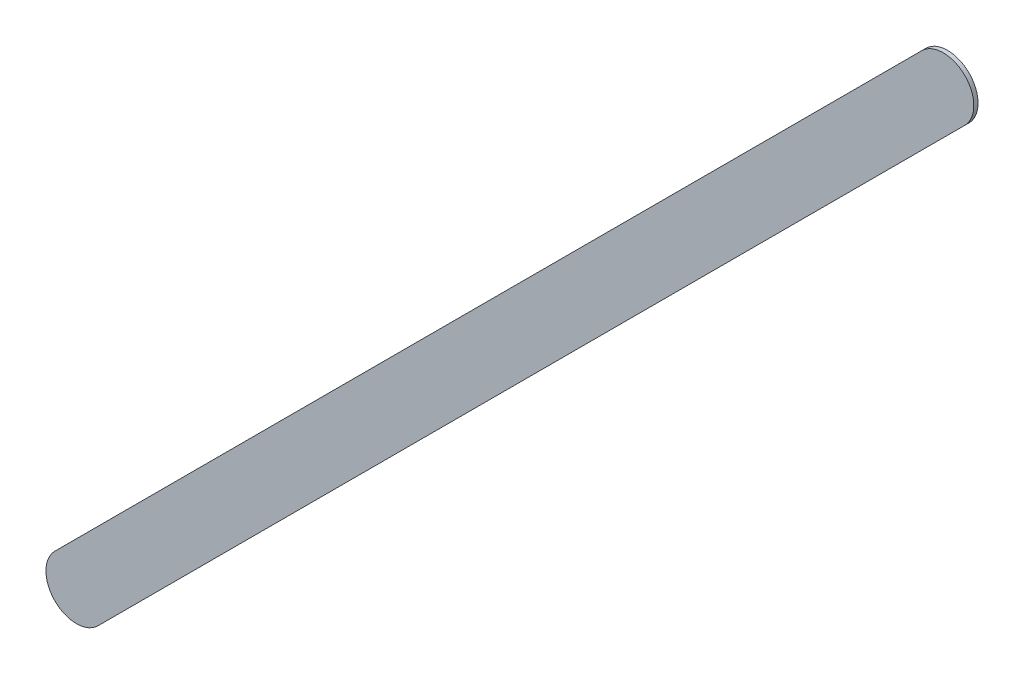
ISO-10303-21;
HEADER;
FILE_DESCRIPTION(('STEP AP214'),'2;1');
FILE_NAME('part.step','',(''),(''),'','','');
FILE_SCHEMA(('AUTOMOTIVE_DESIGN { 1 0 10303 214 1 1 1 1 }'));
ENDSEC;
DATA;
#1=APPLICATION_CONTEXT('core data for automotive mechanical design processes');
#2=APPLICATION_PROTOCOL_DEFINITION('international standard','automotive_design',2000,#1);
#3=PRODUCT_CONTEXT('',#1,'mechanical');
#4=PRODUCT('Part','Part','',(#3));
#5=PRODUCT_RELATED_PRODUCT_CATEGORY('part','',(#4));
#6=PRODUCT_DEFINITION_FORMATION('','',#4);
#7=PRODUCT_DEFINITION_CONTEXT('part definition',#1,'design');
#8=PRODUCT_DEFINITION('design','',#6,#7);
#9=PRODUCT_DEFINITION_SHAPE('','',#8);
#10=(LENGTH_UNIT() NAMED_UNIT(*) SI_UNIT(.MILLI.,.METRE.));
#11=(NAMED_UNIT(*) PLANE_ANGLE_UNIT() SI_UNIT($,.RADIAN.));
#12=(NAMED_UNIT(*) SI_UNIT($,.STERADIAN.) SOLID_ANGLE_UNIT());
#13=UNCERTAINTY_MEASURE_WITH_UNIT(LENGTH_MEASURE(1.E-05),#10,'distance_accuracy_value','');
#14=(GEOMETRIC_REPRESENTATION_CONTEXT(3) GLOBAL_UNCERTAINTY_ASSIGNED_CONTEXT((#13)) GLOBAL_UNIT_ASSIGNED_CONTEXT((#10,
#11,#12)) REPRESENTATION_CONTEXT('',''));
#15=CARTESIAN_POINT('',(0.,0.,0.));
#16=DIRECTION('',(0.,0.,1.));
#17=DIRECTION('',(1.,0.,0.));
#18=AXIS2_PLACEMENT_3D('',#15,#16,#17);
#19=CARTESIAN_POINT('',(154.255223,-72.467223,0.));
#20=DIRECTION('',(0.,0.,1.));
#21=DIRECTION('',(1.,0.,0.));
#22=AXIS2_PLACEMENT_3D('',#19,#20,#21);
#23=PLANE('',#22);
#24=DIRECTION('',(-0.707106781186548,-0.707106781186548,0.));
#25=VECTOR('',#24,1.);
#26=CARTESIAN_POINT('',(154.255223,-72.467223,0.));
#27=LINE('',#26,#25);
#28=CARTESIAN_POINT('',(154.255223,-72.467223,0.));
#29=VERTEX_POINT('',#28);
#30=CARTESIAN_POINT('',(147.143223,-79.579223,0.));
#31=VERTEX_POINT('',#30);
#32=EDGE_CURVE('E99',#29,#31,#27,.T.);
#33=ORIENTED_EDGE('',*,*,#32,.T.);
#34=CARTESIAN_POINT('',(147.3199995,-79.7559995,0.));
#35=DIRECTION('',(0.,0.,1.));
#36=DIRECTION('',(-0.707106781186548,0.707106781186548,0.));
#37=AXIS2_PLACEMENT_3D('',#34,#35,#36);
#38=CIRCLE('',#37,0.249999723809);
#39=CARTESIAN_POINT('',(147.496776,-79.932776,0.));
#40=VERTEX_POINT('',#39);
#41=EDGE_CURVE('E78',#31,#40,#38,.T.);
#42=ORIENTED_EDGE('',*,*,#41,.T.);
#43=DIRECTION('',(0.707106781186548,0.707106781186548,0.));
#44=VECTOR('',#43,1.);
#45=CARTESIAN_POINT('',(147.496776,-79.932776,0.));
#46=LINE('',#45,#44);
#47=CARTESIAN_POINT('',(154.608776,-72.820776,0.));
#48=VERTEX_POINT('',#47);
#49=EDGE_CURVE('E83',#40,#48,#46,.T.);
#50=ORIENTED_EDGE('',*,*,#49,.T.);
#51=CARTESIAN_POINT('',(154.4319995,-72.6439995,0.));
#52=DIRECTION('',(0.,0.,1.));
#53=DIRECTION('',(0.707106781186548,-0.707106781186548,0.));
#54=AXIS2_PLACEMENT_3D('',#51,#52,#53);
#55=CIRCLE('',#54,0.249999723809);
#56=EDGE_CURVE('E11',#48,#29,#55,.T.);
#57=ORIENTED_EDGE('',*,*,#56,.T.);
#58=EDGE_LOOP('',(#33,#42,#50,#57));
#59=FACE_BOUND('',#58,.T.);
#60=ADVANCED_FACE('F17',(#59),#23,.T.);
#61=CARTESIAN_POINT('',(154.255223,-72.467223,-0.035));
#62=DIRECTION('',(0.,0.,1.));
#63=DIRECTION('',(1.,0.,0.));
#64=AXIS2_PLACEMENT_3D('',#61,#62,#63);
#65=PLANE('',#64);
#66=CARTESIAN_POINT('',(154.4319995,-72.6439995,-0.035));
#67=DIRECTION('',(0.,0.,1.));
#68=DIRECTION('',(0.707106781186548,-0.707106781186548,0.));
#69=AXIS2_PLACEMENT_3D('',#66,#67,#68);
#70=CIRCLE('',#69,0.249999723809);
#71=CARTESIAN_POINT('',(154.608776,-72.820776,-0.035));
#72=VERTEX_POINT('',#71);
#73=CARTESIAN_POINT('',(154.255223,-72.467223,-0.035));
#74=VERTEX_POINT('',#73);
#75=EDGE_CURVE('E20',#72,#74,#70,.T.);
#76=ORIENTED_EDGE('',*,*,#75,.F.);
#77=DIRECTION('',(0.707106781186548,0.707106781186548,0.));
#78=VECTOR('',#77,1.);
#79=CARTESIAN_POINT('',(147.496776,-79.932776,-0.035));
#80=LINE('',#79,#78);
#81=CARTESIAN_POINT('',(147.496776,-79.932776,-0.035));
#82=VERTEX_POINT('',#81);
#83=EDGE_CURVE('E68',#82,#72,#80,.T.);
#84=ORIENTED_EDGE('',*,*,#83,.F.);
#85=CARTESIAN_POINT('',(147.3199995,-79.7559995,-0.035));
#86=DIRECTION('',(0.,0.,1.));
#87=DIRECTION('',(-0.707106781186548,0.707106781186548,0.));
#88=AXIS2_PLACEMENT_3D('',#85,#86,#87);
#89=CIRCLE('',#88,0.249999723809);
#90=CARTESIAN_POINT('',(147.143223,-79.579223,-0.035));
#91=VERTEX_POINT('',#90);
#92=EDGE_CURVE('E72',#91,#82,#89,.T.);
#93=ORIENTED_EDGE('',*,*,#92,.F.);
#94=DIRECTION('',(-0.707106781186548,-0.707106781186548,0.));
#95=VECTOR('',#94,1.);
#96=CARTESIAN_POINT('',(154.255223,-72.467223,-0.035));
#97=LINE('',#96,#95);
#98=EDGE_CURVE('E117',#74,#91,#97,.T.);
#99=ORIENTED_EDGE('',*,*,#98,.F.);
#100=EDGE_LOOP('',(#76,#84,#93,#99));
#101=FACE_BOUND('',#100,.T.);
#102=ADVANCED_FACE('F70',(#101),#65,.F.);
#103=CARTESIAN_POINT('',(154.4319995,-72.6439995,-0.035));
#104=DIRECTION('',(0.,0.,-1.));
#105=DIRECTION('',(0.707106781186548,-0.707106781186548,0.));
#106=AXIS2_PLACEMENT_3D('',#103,#104,#105);
#107=CYLINDRICAL_SURFACE('',#106,0.249999723809);
#108=ORIENTED_EDGE('',*,*,#75,.T.);
#109=DIRECTION('',(0.,0.,1.));
#110=VECTOR('',#109,1.);
#111=CARTESIAN_POINT('',(154.255223,-72.467223,-0.035));
#112=LINE('',#111,#110);
#113=EDGE_CURVE('E93',#74,#29,#112,.T.);
#114=ORIENTED_EDGE('',*,*,#113,.T.);
#115=ORIENTED_EDGE('',*,*,#56,.F.);
#116=DIRECTION('',(0.,0.,1.));
#117=VECTOR('',#116,1.);
#118=CARTESIAN_POINT('',(154.608776,-72.820776,-0.035));
#119=LINE('',#118,#117);
#120=EDGE_CURVE('E77',#72,#48,#119,.T.);
#121=ORIENTED_EDGE('',*,*,#120,.F.);
#122=EDGE_LOOP('',(#108,#114,#115,#121));
#123=FACE_BOUND('',#122,.T.);
#124=ADVANCED_FACE('F113',(#123),#107,.T.);
#125=CARTESIAN_POINT('',(147.496776,-79.932776,-0.035));
#126=DIRECTION('',(-0.707106781186548,0.707106781186548,0.));
#127=DIRECTION('',(0.,0.,1.));
#128=AXIS2_PLACEMENT_3D('',#125,#126,#127);
#129=PLANE('',#128);
#130=ORIENTED_EDGE('',*,*,#83,.T.);
#131=ORIENTED_EDGE('',*,*,#120,.T.);
#132=ORIENTED_EDGE('',*,*,#49,.F.);
#133=DIRECTION('',(0.,0.,1.));
#134=VECTOR('',#133,1.);
#135=CARTESIAN_POINT('',(147.496776,-79.932776,-0.035));
#136=LINE('',#135,#134);
#137=EDGE_CURVE('E81',#82,#40,#136,.T.);
#138=ORIENTED_EDGE('',*,*,#137,.F.);
#139=EDGE_LOOP('',(#130,#131,#132,#138));
#140=FACE_BOUND('',#139,.T.);
#141=ADVANCED_FACE('F82',(#140),#129,.F.);
#142=CARTESIAN_POINT('',(147.3199995,-79.7559995,-0.035));
#143=DIRECTION('',(0.,0.,-1.));
#144=DIRECTION('',(-0.707106781186548,0.707106781186548,0.));
#145=AXIS2_PLACEMENT_3D('',#142,#143,#144);
#146=CYLINDRICAL_SURFACE('',#145,0.249999723809);
#147=ORIENTED_EDGE('',*,*,#92,.T.);
#148=ORIENTED_EDGE('',*,*,#137,.T.);
#149=ORIENTED_EDGE('',*,*,#41,.F.);
#150=DIRECTION('',(0.,0.,1.));
#151=VECTOR('',#150,1.);
#152=CARTESIAN_POINT('',(147.143223,-79.579223,-0.035));
#153=LINE('',#152,#151);
#154=EDGE_CURVE('E90',#91,#31,#153,.T.);
#155=ORIENTED_EDGE('',*,*,#154,.F.);
#156=EDGE_LOOP('',(#147,#148,#149,#155));
#157=FACE_BOUND('',#156,.T.);
#158=ADVANCED_FACE('F88',(#157),#146,.T.);
#159=CARTESIAN_POINT('',(154.255223,-72.467223,-0.035));
#160=DIRECTION('',(0.707106781186548,-0.707106781186548,0.));
#161=DIRECTION('',(0.,0.,-1.));
#162=AXIS2_PLACEMENT_3D('',#159,#160,#161);
#163=PLANE('',#162);
#164=ORIENTED_EDGE('',*,*,#98,.T.);
#165=ORIENTED_EDGE('',*,*,#154,.T.);
#166=ORIENTED_EDGE('',*,*,#32,.F.);
#167=ORIENTED_EDGE('',*,*,#113,.F.);
#168=EDGE_LOOP('',(#164,#165,#166,#167));
#169=FACE_BOUND('',#168,.T.);
#170=ADVANCED_FACE('F116',(#169),#163,.F.);
#171=CLOSED_SHELL('',(#60,#102,#124,#141,#158,#170));
#172=MANIFOLD_SOLID_BREP('B1',#171);
#173=ADVANCED_BREP_SHAPE_REPRESENTATION('',(#18,#172),#14);
#174=SHAPE_DEFINITION_REPRESENTATION(#9,#173);
ENDSEC;
END-ISO-10303-21;
